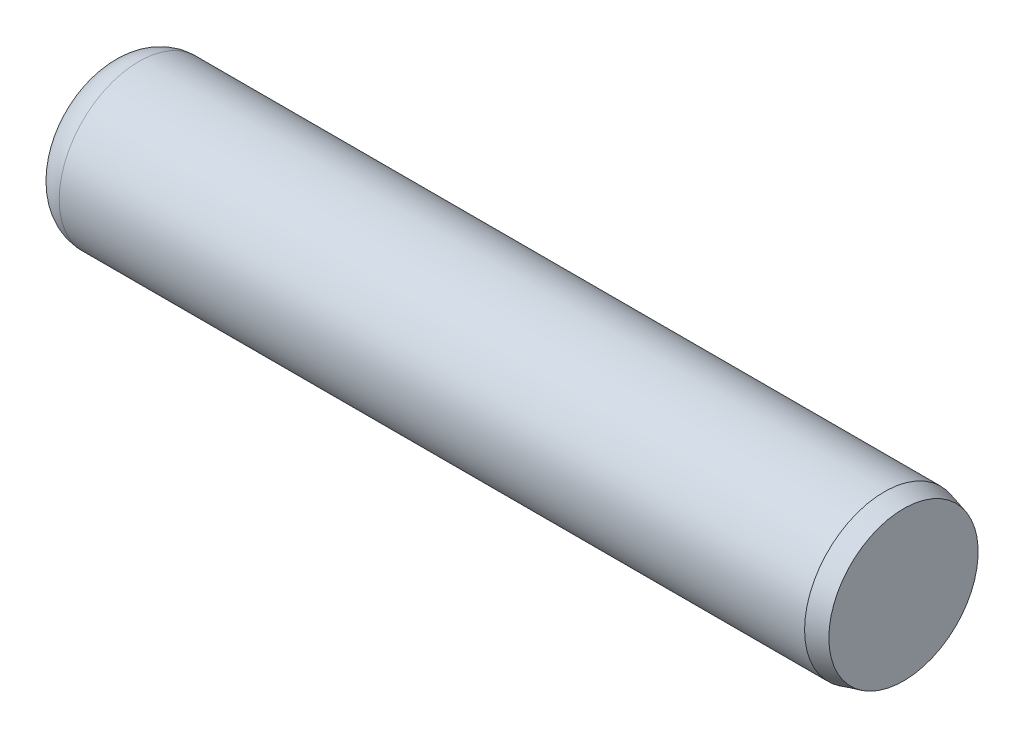
ISO-10303-21;
HEADER;
FILE_DESCRIPTION(('STEP AP214'),'2;1');
FILE_NAME('part.step','',(''),(''),'','','');
FILE_SCHEMA(('AUTOMOTIVE_DESIGN { 1 0 10303 214 1 1 1 1 }'));
ENDSEC;
DATA;
#1=APPLICATION_CONTEXT('core data for automotive mechanical design processes');
#2=APPLICATION_PROTOCOL_DEFINITION('international standard','automotive_design',2000,#1);
#3=PRODUCT_CONTEXT('',#1,'mechanical');
#4=PRODUCT('Part','Part','',(#3));
#5=PRODUCT_RELATED_PRODUCT_CATEGORY('part','',(#4));
#6=PRODUCT_DEFINITION_FORMATION('','',#4);
#7=PRODUCT_DEFINITION_CONTEXT('part definition',#1,'design');
#8=PRODUCT_DEFINITION('design','',#6,#7);
#9=PRODUCT_DEFINITION_SHAPE('','',#8);
#10=(LENGTH_UNIT() NAMED_UNIT(*) SI_UNIT(.MILLI.,.METRE.));
#11=(NAMED_UNIT(*) PLANE_ANGLE_UNIT() SI_UNIT($,.RADIAN.));
#12=(NAMED_UNIT(*) SI_UNIT($,.STERADIAN.) SOLID_ANGLE_UNIT());
#13=UNCERTAINTY_MEASURE_WITH_UNIT(LENGTH_MEASURE(1.E-05),#10,'distance_accuracy_value','');
#14=(GEOMETRIC_REPRESENTATION_CONTEXT(3) GLOBAL_UNCERTAINTY_ASSIGNED_CONTEXT((#13)) GLOBAL_UNIT_ASSIGNED_CONTEXT((#10,
#11,#12)) REPRESENTATION_CONTEXT('',''));
#15=CARTESIAN_POINT('',(0.,0.,0.));
#16=DIRECTION('',(0.,0.,1.));
#17=DIRECTION('',(1.,0.,0.));
#18=AXIS2_PLACEMENT_3D('',#15,#16,#17);
#19=CARTESIAN_POINT('',(0.,0.95402399999997,0.));
#20=DIRECTION('',(1.,0.,0.));
#21=DIRECTION('',(0.,0.,-1.));
#22=AXIS2_PLACEMENT_3D('',#19,#20,#21);
#23=PLANE('',#22);
#24=CARTESIAN_POINT('',(0.,0.,0.));
#25=DIRECTION('',(-1.,0.,0.));
#26=DIRECTION('',(0.,0.,1.));
#27=AXIS2_PLACEMENT_3D('',#24,#25,#26);
#28=CIRCLE('',#27,0.95402399999997);
#29=CARTESIAN_POINT('',(0.,0.,0.95402399999997));
#30=VERTEX_POINT('',#29);
#31=EDGE_CURVE('E44',#30,#30,#28,.T.);
#32=ORIENTED_EDGE('',*,*,#31,.T.);
#33=EDGE_LOOP('',(#32));
#34=FACE_BOUND('',#33,.T.);
#35=ADVANCED_FACE('F30',(#34),#23,.F.);
#36=CARTESIAN_POINT('',(15.875,0.,0.));
#37=DIRECTION('',(-1.,0.,0.));
#38=DIRECTION('',(0.,0.,1.));
#39=AXIS2_PLACEMENT_3D('',#36,#37,#38);
#40=PLANE('',#39);
#41=CARTESIAN_POINT('',(15.875,0.,0.));
#42=DIRECTION('',(-1.,0.,0.));
#43=DIRECTION('',(0.,0.,1.));
#44=AXIS2_PLACEMENT_3D('',#41,#42,#43);
#45=CIRCLE('',#44,1.48778801585601);
#46=CARTESIAN_POINT('',(15.875,0.,1.48778801585601));
#47=VERTEX_POINT('',#46);
#48=EDGE_CURVE('E10',#47,#47,#45,.T.);
#49=ORIENTED_EDGE('',*,*,#48,.F.);
#50=EDGE_LOOP('',(#49));
#51=FACE_BOUND('',#50,.T.);
#52=ADVANCED_FACE('F64',(#51),#40,.F.);
#53=CARTESIAN_POINT('',(15.875,0.,0.));
#54=DIRECTION('',(-1.,0.,0.));
#55=DIRECTION('',(0.,0.,1.));
#56=AXIS2_PLACEMENT_3D('',#53,#54,#55);
#57=CONICAL_SURFACE('',#56,1.48778801585601,0.261799387799155);
#58=CARTESIAN_POINT('',(15.4933904,0.,0.));
#59=DIRECTION('',(-1.,0.,0.));
#60=DIRECTION('',(0.,0.,1.));
#61=AXIS2_PLACEMENT_3D('',#58,#59,#60);
#62=CIRCLE('',#61,1.59003999999997);
#63=CARTESIAN_POINT('',(15.4933904,0.,1.59003999999997));
#64=VERTEX_POINT('',#63);
#65=EDGE_CURVE('E36',#64,#64,#62,.T.);
#66=ORIENTED_EDGE('',*,*,#65,.F.);
#67=EDGE_LOOP('',(#66));
#68=FACE_BOUND('',#67,.T.);
#69=ORIENTED_EDGE('',*,*,#48,.T.);
#70=EDGE_LOOP('',(#69));
#71=FACE_BOUND('',#70,.T.);
#72=ADVANCED_FACE('F59',(#68,#71),#57,.T.);
#73=CARTESIAN_POINT('',(-6.35,0.,0.));
#74=DIRECTION('',(-1.,0.,0.));
#75=DIRECTION('',(0.,0.,1.));
#76=AXIS2_PLACEMENT_3D('',#73,#74,#75);
#77=CYLINDRICAL_SURFACE('',#76,1.59003999999997);
#78=CARTESIAN_POINT('',(0.636016000000003,0.,0.));
#79=DIRECTION('',(-1.,0.,0.));
#80=DIRECTION('',(0.,0.,1.));
#81=AXIS2_PLACEMENT_3D('',#78,#79,#80);
#82=CIRCLE('',#81,1.59003999999997);
#83=CARTESIAN_POINT('',(0.636016000000003,0.,1.59003999999997));
#84=VERTEX_POINT('',#83);
#85=EDGE_CURVE('E40',#84,#84,#82,.T.);
#86=ORIENTED_EDGE('',*,*,#85,.F.);
#87=EDGE_LOOP('',(#86));
#88=FACE_BOUND('',#87,.T.);
#89=ORIENTED_EDGE('',*,*,#65,.T.);
#90=EDGE_LOOP('',(#89));
#91=FACE_BOUND('',#90,.T.);
#92=ADVANCED_FACE('F54',(#88,#91),#77,.T.);
#93=CARTESIAN_POINT('',(0.636016000000003,0.,0.));
#94=DIRECTION('',(-1.,0.,0.));
#95=DIRECTION('',(0.,0.,1.));
#96=AXIS2_PLACEMENT_3D('',#93,#94,#95);
#97=TOROIDAL_SURFACE('',#96,0.95402399999997,0.636016000000001);
#98=ORIENTED_EDGE('',*,*,#31,.F.);
#99=EDGE_LOOP('',(#98));
#100=FACE_BOUND('',#99,.T.);
#101=ORIENTED_EDGE('',*,*,#85,.T.);
#102=EDGE_LOOP('',(#101));
#103=FACE_BOUND('',#102,.T.);
#104=ADVANCED_FACE('F51',(#100,#103),#97,.T.);
#105=CLOSED_SHELL('',(#35,#52,#72,#92,#104));
#106=MANIFOLD_SOLID_BREP('B2',#105);
#107=ADVANCED_BREP_SHAPE_REPRESENTATION('',(#18,#106),#14);
#108=SHAPE_DEFINITION_REPRESENTATION(#9,#107);
ENDSEC;
END-ISO-10303-21;
